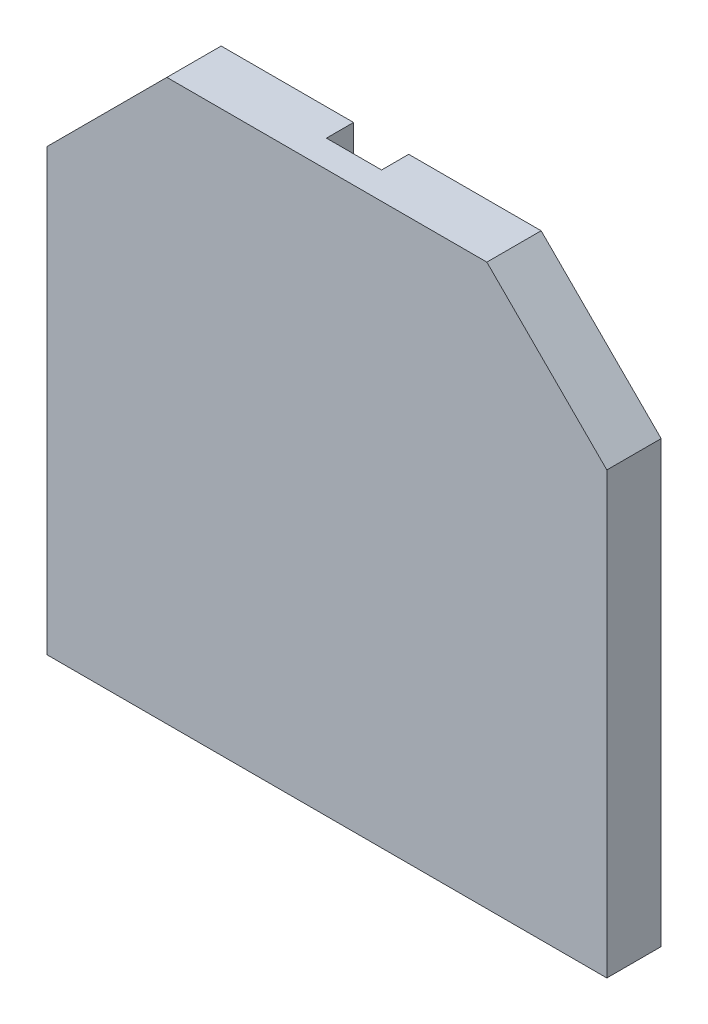
ISO-10303-21;
HEADER;
FILE_DESCRIPTION(('STEP AP214'),'2;1');
FILE_NAME('part.step','',(''),(''),'','','');
FILE_SCHEMA(('AUTOMOTIVE_DESIGN { 1 0 10303 214 1 1 1 1 }'));
ENDSEC;
DATA;
#1=APPLICATION_CONTEXT('core data for automotive mechanical design processes');
#2=APPLICATION_PROTOCOL_DEFINITION('international standard','automotive_design',2000,#1);
#3=PRODUCT_CONTEXT('',#1,'mechanical');
#4=PRODUCT('Part','Part','',(#3));
#5=PRODUCT_RELATED_PRODUCT_CATEGORY('part','',(#4));
#6=PRODUCT_DEFINITION_FORMATION('','',#4);
#7=PRODUCT_DEFINITION_CONTEXT('part definition',#1,'design');
#8=PRODUCT_DEFINITION('design','',#6,#7);
#9=PRODUCT_DEFINITION_SHAPE('','',#8);
#10=(LENGTH_UNIT() NAMED_UNIT(*) SI_UNIT(.MILLI.,.METRE.));
#11=(NAMED_UNIT(*) PLANE_ANGLE_UNIT() SI_UNIT($,.RADIAN.));
#12=(NAMED_UNIT(*) SI_UNIT($,.STERADIAN.) SOLID_ANGLE_UNIT());
#13=UNCERTAINTY_MEASURE_WITH_UNIT(LENGTH_MEASURE(1.E-05),#10,'distance_accuracy_value','');
#14=(GEOMETRIC_REPRESENTATION_CONTEXT(3) GLOBAL_UNCERTAINTY_ASSIGNED_CONTEXT((#13)) GLOBAL_UNIT_ASSIGNED_CONTEXT((#10,
#11,#12)) REPRESENTATION_CONTEXT('',''));
#15=CARTESIAN_POINT('',(0.,0.,0.));
#16=DIRECTION('',(0.,0.,1.));
#17=DIRECTION('',(1.,0.,0.));
#18=AXIS2_PLACEMENT_3D('',#15,#16,#17);
#19=CARTESIAN_POINT('',(-0.32500316,0.68579492,0.31999936));
#20=DIRECTION('',(0.,0.,-1.));
#21=DIRECTION('',(-1.,0.,0.));
#22=AXIS2_PLACEMENT_3D('',#19,#20,#21);
#23=PLANE('',#22);
#24=DIRECTION('',(-1.,0.,0.));
#25=VECTOR('',#24,1.);
#26=CARTESIAN_POINT('',(-0.32500316,0.48579532,0.31999936));
#27=LINE('',#26,#25);
#28=CARTESIAN_POINT('',(-0.32500316,0.48579532,0.31999936));
#29=VERTEX_POINT('',#28);
#30=CARTESIAN_POINT('',(0.32499808,0.48579532,0.31999936));
#31=VERTEX_POINT('',#30);
#32=EDGE_CURVE('E20',#29,#31,#27,.F.);
#33=ORIENTED_EDGE('',*,*,#32,.T.);
#34=DIRECTION('',(0.,1.,0.));
#35=VECTOR('',#34,1.);
#36=CARTESIAN_POINT('',(0.32499808,-1.91420496,0.31999936));
#37=LINE('',#36,#35);
#38=CARTESIAN_POINT('',(0.32499808,-1.91420496,0.31999936));
#39=VERTEX_POINT('',#38);
#40=EDGE_CURVE('E115',#39,#31,#37,.T.);
#41=ORIENTED_EDGE('',*,*,#40,.F.);
#42=DIRECTION('',(1.,0.,0.));
#43=VECTOR('',#42,1.);
#44=CARTESIAN_POINT('',(-0.32500316,-1.91420496,0.31999936));
#45=LINE('',#44,#43);
#46=CARTESIAN_POINT('',(-0.32500316,-1.91420496,0.31999936));
#47=VERTEX_POINT('',#46);
#48=EDGE_CURVE('E132',#47,#39,#45,.T.);
#49=ORIENTED_EDGE('',*,*,#48,.F.);
#50=DIRECTION('',(0.,1.,0.));
#51=VECTOR('',#50,1.);
#52=CARTESIAN_POINT('',(-0.32500316,0.68579492,0.31999936));
#53=LINE('',#52,#51);
#54=EDGE_CURVE('E120',#29,#47,#53,.F.);
#55=ORIENTED_EDGE('',*,*,#54,.F.);
#56=EDGE_LOOP('',(#33,#41,#49,#55));
#57=FACE_BOUND('',#56,.T.);
#58=ADVANCED_FACE('F17',(#57),#23,.T.);
#59=CARTESIAN_POINT('',(-0.32500316,-3.71420136,0.31999936));
#60=DIRECTION('',(0.,0.,-1.));
#61=DIRECTION('',(-1.,0.,0.));
#62=AXIS2_PLACEMENT_3D('',#59,#60,#61);
#63=PLANE('',#62);
#64=DIRECTION('',(-1.,0.,0.));
#65=VECTOR('',#64,1.);
#66=CARTESIAN_POINT('',(-0.32500316,-6.11420164,0.31999936));
#67=LINE('',#66,#65);
#68=CARTESIAN_POINT('',(0.32499808,-6.11420164,0.31999936));
#69=VERTEX_POINT('',#68);
#70=CARTESIAN_POINT('',(-0.32500316,-6.11420164,0.31999936));
#71=VERTEX_POINT('',#70);
#72=EDGE_CURVE('E123',#69,#71,#67,.T.);
#73=ORIENTED_EDGE('',*,*,#72,.T.);
#74=DIRECTION('',(0.,1.,0.));
#75=VECTOR('',#74,1.);
#76=CARTESIAN_POINT('',(-0.32500316,-3.71420136,0.31999936));
#77=LINE('',#76,#75);
#78=CARTESIAN_POINT('',(-0.32500316,-3.71420136,0.31999936));
#79=VERTEX_POINT('',#78);
#80=EDGE_CURVE('E148',#79,#71,#77,.F.);
#81=ORIENTED_EDGE('',*,*,#80,.F.);
#82=DIRECTION('',(1.,0.,0.));
#83=VECTOR('',#82,1.);
#84=CARTESIAN_POINT('',(0.32499808,-3.71420136,0.31999936));
#85=LINE('',#84,#83);
#86=CARTESIAN_POINT('',(0.32499808,-3.71420136,0.31999936));
#87=VERTEX_POINT('',#86);
#88=EDGE_CURVE('E153',#87,#79,#85,.F.);
#89=ORIENTED_EDGE('',*,*,#88,.F.);
#90=DIRECTION('',(0.,1.,0.));
#91=VECTOR('',#90,1.);
#92=CARTESIAN_POINT('',(0.32499808,-6.31420124,0.31999936));
#93=LINE('',#92,#91);
#94=EDGE_CURVE('E165',#69,#87,#93,.T.);
#95=ORIENTED_EDGE('',*,*,#94,.F.);
#96=EDGE_LOOP('',(#73,#81,#89,#95));
#97=FACE_BOUND('',#96,.T.);
#98=ADVANCED_FACE('F251',(#97),#63,.T.);
#99=CARTESIAN_POINT('',(0.32499808,-1.91420496,-1.00000054));
#100=DIRECTION('',(-1.,0.,0.));
#101=DIRECTION('',(0.,0.,1.));
#102=AXIS2_PLACEMENT_3D('',#99,#100,#101);
#103=PLANE('',#102);
#104=DIRECTION('',(0.,0.,1.));
#105=VECTOR('',#104,1.);
#106=CARTESIAN_POINT('',(0.32499808,0.48579532,-1.00000054));
#107=LINE('',#106,#105);
#108=CARTESIAN_POINT('',(0.32499808,0.48579532,0.));
#109=VERTEX_POINT('',#108);
#110=EDGE_CURVE('E125',#31,#109,#107,.F.);
#111=ORIENTED_EDGE('',*,*,#110,.T.);
#112=DIRECTION('',(0.,1.,0.));
#113=VECTOR('',#112,1.);
#114=CARTESIAN_POINT('',(0.32499808,0.48579532,0.));
#115=LINE('',#114,#113);
#116=CARTESIAN_POINT('',(0.32499808,-1.91420496,0.));
#117=VERTEX_POINT('',#116);
#118=EDGE_CURVE('E168',#109,#117,#115,.F.);
#119=ORIENTED_EDGE('',*,*,#118,.T.);
#120=DIRECTION('',(0.,0.,1.));
#121=VECTOR('',#120,1.);
#122=CARTESIAN_POINT('',(0.32499808,-1.91420496,-1.00000054));
#123=LINE('',#122,#121);
#124=EDGE_CURVE('E136',#39,#117,#123,.F.);
#125=ORIENTED_EDGE('',*,*,#124,.F.);
#126=ORIENTED_EDGE('',*,*,#40,.T.);
#127=EDGE_LOOP('',(#111,#119,#125,#126));
#128=FACE_BOUND('',#127,.T.);
#129=ADVANCED_FACE('F134',(#128),#103,.T.);
#130=CARTESIAN_POINT('',(-0.32500316,-1.91420496,-1.00000054));
#131=DIRECTION('',(0.,1.,0.));
#132=DIRECTION('',(0.,0.,1.));
#133=AXIS2_PLACEMENT_3D('',#130,#131,#132);
#134=PLANE('',#133);
#135=ORIENTED_EDGE('',*,*,#124,.T.);
#136=DIRECTION('',(1.,0.,0.));
#137=VECTOR('',#136,1.);
#138=CARTESIAN_POINT('',(-1.88578998,-1.91420496,0.));
#139=LINE('',#138,#137);
#140=CARTESIAN_POINT('',(-0.32500316,-1.91420496,0.));
#141=VERTEX_POINT('',#140);
#142=EDGE_CURVE('E170',#117,#141,#139,.F.);
#143=ORIENTED_EDGE('',*,*,#142,.T.);
#144=DIRECTION('',(0.,0.,-1.));
#145=VECTOR('',#144,1.);
#146=CARTESIAN_POINT('',(-0.32500316,-1.91420496,-1.00000054));
#147=LINE('',#146,#145);
#148=EDGE_CURVE('E142',#47,#141,#147,.T.);
#149=ORIENTED_EDGE('',*,*,#148,.F.);
#150=ORIENTED_EDGE('',*,*,#48,.T.);
#151=EDGE_LOOP('',(#135,#143,#149,#150));
#152=FACE_BOUND('',#151,.T.);
#153=ADVANCED_FACE('F271',(#152),#134,.T.);
#154=CARTESIAN_POINT('',(-0.32500316,0.68579492,-1.00000054));
#155=DIRECTION('',(1.,0.,0.));
#156=DIRECTION('',(0.,0.,-1.));
#157=AXIS2_PLACEMENT_3D('',#154,#155,#156);
#158=PLANE('',#157);
#159=DIRECTION('',(0.,0.,-1.));
#160=VECTOR('',#159,1.);
#161=CARTESIAN_POINT('',(-0.32500316,0.48579532,-1.00000054));
#162=LINE('',#161,#160);
#163=CARTESIAN_POINT('',(-0.32500316,0.48579532,0.));
#164=VERTEX_POINT('',#163);
#165=EDGE_CURVE('E145',#164,#29,#162,.F.);
#166=ORIENTED_EDGE('',*,*,#165,.T.);
#167=ORIENTED_EDGE('',*,*,#54,.T.);
#168=ORIENTED_EDGE('',*,*,#148,.T.);
#169=DIRECTION('',(0.,1.,0.));
#170=VECTOR('',#169,1.);
#171=CARTESIAN_POINT('',(-0.32500316,0.48579532,0.));
#172=LINE('',#171,#170);
#173=EDGE_CURVE('E172',#141,#164,#172,.T.);
#174=ORIENTED_EDGE('',*,*,#173,.T.);
#175=EDGE_LOOP('',(#166,#167,#168,#174));
#176=FACE_BOUND('',#175,.T.);
#177=ADVANCED_FACE('F268',(#176),#158,.T.);
#178=CARTESIAN_POINT('',(-0.32500316,-3.71420136,-1.00000054));
#179=DIRECTION('',(1.,0.,0.));
#180=DIRECTION('',(0.,0.,-1.));
#181=AXIS2_PLACEMENT_3D('',#178,#179,#180);
#182=PLANE('',#181);
#183=DIRECTION('',(0.,0.,-1.));
#184=VECTOR('',#183,1.);
#185=CARTESIAN_POINT('',(-0.32500316,-6.11420164,-1.00000054));
#186=LINE('',#185,#184);
#187=CARTESIAN_POINT('',(-0.32500316,-6.11420164,0.));
#188=VERTEX_POINT('',#187);
#189=EDGE_CURVE('E151',#71,#188,#186,.T.);
#190=ORIENTED_EDGE('',*,*,#189,.T.);
#191=DIRECTION('',(0.,1.,0.));
#192=VECTOR('',#191,1.);
#193=CARTESIAN_POINT('',(-0.32500316,0.48579532,0.));
#194=LINE('',#193,#192);
#195=CARTESIAN_POINT('',(-0.32500316,-3.71420136,0.));
#196=VERTEX_POINT('',#195);
#197=EDGE_CURVE('E175',#188,#196,#194,.T.);
#198=ORIENTED_EDGE('',*,*,#197,.T.);
#199=DIRECTION('',(0.,0.,-1.));
#200=VECTOR('',#199,1.);
#201=CARTESIAN_POINT('',(-0.32500316,-3.71420136,-1.00000054));
#202=LINE('',#201,#200);
#203=EDGE_CURVE('E156',#79,#196,#202,.T.);
#204=ORIENTED_EDGE('',*,*,#203,.F.);
#205=ORIENTED_EDGE('',*,*,#80,.T.);
#206=EDGE_LOOP('',(#190,#198,#204,#205));
#207=FACE_BOUND('',#206,.T.);
#208=ADVANCED_FACE('F245',(#207),#182,.T.);
#209=CARTESIAN_POINT('',(0.32499808,-3.71420136,-1.00000054));
#210=DIRECTION('',(0.,-1.,0.));
#211=DIRECTION('',(0.,0.,-1.));
#212=AXIS2_PLACEMENT_3D('',#209,#210,#211);
#213=PLANE('',#212);
#214=ORIENTED_EDGE('',*,*,#203,.T.);
#215=DIRECTION('',(1.,0.,0.));
#216=VECTOR('',#215,1.);
#217=CARTESIAN_POINT('',(-1.88578998,-3.71420136,0.));
#218=LINE('',#217,#216);
#219=CARTESIAN_POINT('',(0.32499808,-3.71420136,0.));
#220=VERTEX_POINT('',#219);
#221=EDGE_CURVE('E177',#196,#220,#218,.T.);
#222=ORIENTED_EDGE('',*,*,#221,.T.);
#223=DIRECTION('',(0.,0.,1.));
#224=VECTOR('',#223,1.);
#225=CARTESIAN_POINT('',(0.32499808,-3.71420136,-1.00000054));
#226=LINE('',#225,#224);
#227=EDGE_CURVE('E159',#87,#220,#226,.F.);
#228=ORIENTED_EDGE('',*,*,#227,.F.);
#229=ORIENTED_EDGE('',*,*,#88,.T.);
#230=EDGE_LOOP('',(#214,#222,#228,#229));
#231=FACE_BOUND('',#230,.T.);
#232=ADVANCED_FACE('F247',(#231),#213,.T.);
#233=CARTESIAN_POINT('',(0.32499808,-6.31420124,-1.00000054));
#234=DIRECTION('',(-1.,0.,0.));
#235=DIRECTION('',(0.,0.,1.));
#236=AXIS2_PLACEMENT_3D('',#233,#234,#235);
#237=PLANE('',#236);
#238=DIRECTION('',(0.,0.,1.));
#239=VECTOR('',#238,1.);
#240=CARTESIAN_POINT('',(0.32499808,-6.11420164,-1.00000054));
#241=LINE('',#240,#239);
#242=CARTESIAN_POINT('',(0.32499808,-6.11420164,0.));
#243=VERTEX_POINT('',#242);
#244=EDGE_CURVE('E162',#243,#69,#241,.T.);
#245=ORIENTED_EDGE('',*,*,#244,.T.);
#246=ORIENTED_EDGE('',*,*,#94,.T.);
#247=ORIENTED_EDGE('',*,*,#227,.T.);
#248=DIRECTION('',(0.,1.,0.));
#249=VECTOR('',#248,1.);
#250=CARTESIAN_POINT('',(0.32499808,0.48579532,0.));
#251=LINE('',#250,#249);
#252=EDGE_CURVE('E179',#220,#243,#251,.F.);
#253=ORIENTED_EDGE('',*,*,#252,.T.);
#254=EDGE_LOOP('',(#245,#246,#247,#253));
#255=FACE_BOUND('',#254,.T.);
#256=ADVANCED_FACE('F255',(#255),#237,.T.);
#257=CARTESIAN_POINT('',(-1.88578998,0.48579532,0.));
#258=DIRECTION('',(0.,0.,1.));
#259=DIRECTION('',(1.,0.,0.));
#260=AXIS2_PLACEMENT_3D('',#257,#258,#259);
#261=PLANE('',#260);
#262=DIRECTION('',(-0.707106781186548,0.707106781186548,0.));
#263=VECTOR('',#262,1.);
#264=CARTESIAN_POINT('',(1.8857849,0.48579532,0.));
#265=LINE('',#264,#263);
#266=CARTESIAN_POINT('',(3.29999848,-0.92841826,0.));
#267=VERTEX_POINT('',#266);
#268=CARTESIAN_POINT('',(1.8857849,0.48579532,0.));
#269=VERTEX_POINT('',#268);
#270=EDGE_CURVE('E182',#267,#269,#265,.T.);
#271=ORIENTED_EDGE('',*,*,#270,.F.);
#272=DIRECTION('',(0.,1.,0.));
#273=VECTOR('',#272,1.);
#274=CARTESIAN_POINT('',(3.29999848,-0.92841826,0.));
#275=LINE('',#274,#273);
#276=CARTESIAN_POINT('',(3.29999848,-6.11420164,0.));
#277=VERTEX_POINT('',#276);
#278=EDGE_CURVE('E209',#277,#267,#275,.T.);
#279=ORIENTED_EDGE('',*,*,#278,.F.);
#280=DIRECTION('',(1.,0.,0.));
#281=VECTOR('',#280,1.);
#282=CARTESIAN_POINT('',(3.29999848,-6.11420164,0.));
#283=LINE('',#282,#281);
#284=EDGE_CURVE('E206',#243,#277,#283,.T.);
#285=ORIENTED_EDGE('',*,*,#284,.F.);
#286=ORIENTED_EDGE('',*,*,#252,.F.);
#287=ORIENTED_EDGE('',*,*,#221,.F.);
#288=ORIENTED_EDGE('',*,*,#197,.F.);
#289=DIRECTION('',(1.,0.,0.));
#290=VECTOR('',#289,1.);
#291=CARTESIAN_POINT('',(3.29999848,-6.11420164,0.));
#292=LINE('',#291,#290);
#293=CARTESIAN_POINT('',(-3.30000356,-6.11420164,0.));
#294=VERTEX_POINT('',#293);
#295=EDGE_CURVE('E203',#294,#188,#292,.T.);
#296=ORIENTED_EDGE('',*,*,#295,.F.);
#297=DIRECTION('',(0.,1.,0.));
#298=VECTOR('',#297,1.);
#299=CARTESIAN_POINT('',(-3.30000356,-6.11420164,0.));
#300=LINE('',#299,#298);
#301=CARTESIAN_POINT('',(-3.30000356,-0.92841826,0.));
#302=VERTEX_POINT('',#301);
#303=EDGE_CURVE('E198',#302,#294,#300,.F.);
#304=ORIENTED_EDGE('',*,*,#303,.F.);
#305=DIRECTION('',(-0.707106781186548,-0.707106781186548,0.));
#306=VECTOR('',#305,1.);
#307=CARTESIAN_POINT('',(-3.30000356,-0.92841826,0.));
#308=LINE('',#307,#306);
#309=CARTESIAN_POINT('',(-1.88578998,0.48579532,0.));
#310=VERTEX_POINT('',#309);
#311=EDGE_CURVE('E193',#310,#302,#308,.T.);
#312=ORIENTED_EDGE('',*,*,#311,.F.);
#313=DIRECTION('',(1.,0.,0.));
#314=VECTOR('',#313,1.);
#315=CARTESIAN_POINT('',(-1.88578998,0.48579532,0.));
#316=LINE('',#315,#314);
#317=EDGE_CURVE('E186',#164,#310,#316,.F.);
#318=ORIENTED_EDGE('',*,*,#317,.F.);
#319=ORIENTED_EDGE('',*,*,#173,.F.);
#320=ORIENTED_EDGE('',*,*,#142,.F.);
#321=ORIENTED_EDGE('',*,*,#118,.F.);
#322=DIRECTION('',(1.,0.,0.));
#323=VECTOR('',#322,1.);
#324=CARTESIAN_POINT('',(-1.88578998,0.48579532,0.));
#325=LINE('',#324,#323);
#326=EDGE_CURVE('E129',#269,#109,#325,.F.);
#327=ORIENTED_EDGE('',*,*,#326,.F.);
#328=EDGE_LOOP('',(#271,#279,#285,#286,#287,#288,#296,#304,#312,#318,#319,#320,#321,#327));
#329=FACE_BOUND('',#328,.T.);
#330=ADVANCED_FACE('F240',(#329),#261,.F.);
#331=CARTESIAN_POINT('',(1.8857849,0.48579532,0.));
#332=DIRECTION('',(0.707106781186548,0.707106781186548,0.));
#333=DIRECTION('',(-0.707106781186548,0.707106781186548,0.));
#334=AXIS2_PLACEMENT_3D('',#331,#332,#333);
#335=PLANE('',#334);
#336=DIRECTION('',(0.,0.,1.));
#337=VECTOR('',#336,1.);
#338=CARTESIAN_POINT('',(1.8857849,0.48579532,0.));
#339=LINE('',#338,#337);
#340=CARTESIAN_POINT('',(1.8857849,0.48579532,0.64000126));
#341=VERTEX_POINT('',#340);
#342=EDGE_CURVE('E188',#341,#269,#339,.F.);
#343=ORIENTED_EDGE('',*,*,#342,.F.);
#344=DIRECTION('',(-0.707106781186548,0.707106781186547,0.));
#345=VECTOR('',#344,1.);
#346=CARTESIAN_POINT('',(3.29999848,-0.92841826,0.64000126));
#347=LINE('',#346,#345);
#348=CARTESIAN_POINT('',(3.29999848,-0.92841826,0.64000126));
#349=VERTEX_POINT('',#348);
#350=EDGE_CURVE('E215',#349,#341,#347,.T.);
#351=ORIENTED_EDGE('',*,*,#350,.F.);
#352=DIRECTION('',(0.,0.,-1.));
#353=VECTOR('',#352,1.);
#354=CARTESIAN_POINT('',(3.29999848,-0.92841826,0.));
#355=LINE('',#354,#353);
#356=EDGE_CURVE('E212',#267,#349,#355,.F.);
#357=ORIENTED_EDGE('',*,*,#356,.F.);
#358=ORIENTED_EDGE('',*,*,#270,.T.);
#359=EDGE_LOOP('',(#343,#351,#357,#358));
#360=FACE_BOUND('',#359,.T.);
#361=ADVANCED_FACE('F260',(#360),#335,.T.);
#362=CARTESIAN_POINT('',(-1.88578998,0.48579532,0.));
#363=DIRECTION('',(0.,1.,0.));
#364=DIRECTION('',(0.,0.,1.));
#365=AXIS2_PLACEMENT_3D('',#362,#363,#364);
#366=PLANE('',#365);
#367=DIRECTION('',(1.,0.,0.));
#368=VECTOR('',#367,1.);
#369=CARTESIAN_POINT('',(-1.88578998,0.48579532,0.64000126));
#370=LINE('',#369,#368);
#371=CARTESIAN_POINT('',(-1.88578998,0.48579532,0.64000126));
#372=VERTEX_POINT('',#371);
#373=EDGE_CURVE('E218',#341,#372,#370,.F.);
#374=ORIENTED_EDGE('',*,*,#373,.F.);
#375=ORIENTED_EDGE('',*,*,#342,.T.);
#376=ORIENTED_EDGE('',*,*,#326,.T.);
#377=ORIENTED_EDGE('',*,*,#110,.F.);
#378=ORIENTED_EDGE('',*,*,#32,.F.);
#379=ORIENTED_EDGE('',*,*,#165,.F.);
#380=ORIENTED_EDGE('',*,*,#317,.T.);
#381=DIRECTION('',(0.,0.,1.));
#382=VECTOR('',#381,1.);
#383=CARTESIAN_POINT('',(-1.88578998,0.48579532,0.));
#384=LINE('',#383,#382);
#385=EDGE_CURVE('E190',#372,#310,#384,.F.);
#386=ORIENTED_EDGE('',*,*,#385,.F.);
#387=EDGE_LOOP('',(#374,#375,#376,#377,#378,#379,#380,#386));
#388=FACE_BOUND('',#387,.T.);
#389=ADVANCED_FACE('F127',(#388),#366,.T.);
#390=CARTESIAN_POINT('',(-3.30000356,-0.92841826,0.));
#391=DIRECTION('',(-0.707106781186548,0.707106781186548,0.));
#392=DIRECTION('',(-0.707106781186548,-0.707106781186548,0.));
#393=AXIS2_PLACEMENT_3D('',#390,#391,#392);
#394=PLANE('',#393);
#395=DIRECTION('',(0.,0.,1.));
#396=VECTOR('',#395,1.);
#397=CARTESIAN_POINT('',(-3.30000356,-0.92841826,0.));
#398=LINE('',#397,#396);
#399=CARTESIAN_POINT('',(-3.30000356,-0.92841826,0.64000126));
#400=VERTEX_POINT('',#399);
#401=EDGE_CURVE('E195',#400,#302,#398,.F.);
#402=ORIENTED_EDGE('',*,*,#401,.F.);
#403=DIRECTION('',(-0.707106781186548,-0.707106781186547,0.));
#404=VECTOR('',#403,1.);
#405=CARTESIAN_POINT('',(-1.88578998,0.48579532,0.64000126));
#406=LINE('',#405,#404);
#407=EDGE_CURVE('E221',#372,#400,#406,.T.);
#408=ORIENTED_EDGE('',*,*,#407,.F.);
#409=ORIENTED_EDGE('',*,*,#385,.T.);
#410=ORIENTED_EDGE('',*,*,#311,.T.);
#411=EDGE_LOOP('',(#402,#408,#409,#410));
#412=FACE_BOUND('',#411,.T.);
#413=ADVANCED_FACE('F264',(#412),#394,.T.);
#414=CARTESIAN_POINT('',(-3.30000356,-6.11420164,0.));
#415=DIRECTION('',(-1.,0.,0.));
#416=DIRECTION('',(0.,0.,1.));
#417=AXIS2_PLACEMENT_3D('',#414,#415,#416);
#418=PLANE('',#417);
#419=DIRECTION('',(0.,0.,-1.));
#420=VECTOR('',#419,1.);
#421=CARTESIAN_POINT('',(-3.30000356,-6.11420164,0.));
#422=LINE('',#421,#420);
#423=CARTESIAN_POINT('',(-3.30000356,-6.11420164,0.64000126));
#424=VERTEX_POINT('',#423);
#425=EDGE_CURVE('E200',#424,#294,#422,.T.);
#426=ORIENTED_EDGE('',*,*,#425,.F.);
#427=DIRECTION('',(0.,1.,0.));
#428=VECTOR('',#427,1.);
#429=CARTESIAN_POINT('',(-3.30000356,0.48579532,0.64000126));
#430=LINE('',#429,#428);
#431=EDGE_CURVE('E224',#400,#424,#430,.F.);
#432=ORIENTED_EDGE('',*,*,#431,.F.);
#433=ORIENTED_EDGE('',*,*,#401,.T.);
#434=ORIENTED_EDGE('',*,*,#303,.T.);
#435=EDGE_LOOP('',(#426,#432,#433,#434));
#436=FACE_BOUND('',#435,.T.);
#437=ADVANCED_FACE('F235',(#436),#418,.T.);
#438=CARTESIAN_POINT('',(3.29999848,-6.11420164,0.));
#439=DIRECTION('',(0.,-1.,0.));
#440=DIRECTION('',(0.,0.,-1.));
#441=AXIS2_PLACEMENT_3D('',#438,#439,#440);
#442=PLANE('',#441);
#443=ORIENTED_EDGE('',*,*,#284,.T.);
#444=DIRECTION('',(0.,0.,-1.));
#445=VECTOR('',#444,1.);
#446=CARTESIAN_POINT('',(3.29999848,-6.11420164,0.));
#447=LINE('',#446,#445);
#448=CARTESIAN_POINT('',(3.29999848,-6.11420164,0.64000126));
#449=VERTEX_POINT('',#448);
#450=EDGE_CURVE('E35',#449,#277,#447,.T.);
#451=ORIENTED_EDGE('',*,*,#450,.F.);
#452=DIRECTION('',(1.,0.,0.));
#453=VECTOR('',#452,1.);
#454=CARTESIAN_POINT('',(-1.88578998,-6.11420164,0.64000126));
#455=LINE('',#454,#453);
#456=EDGE_CURVE('E26',#424,#449,#455,.T.);
#457=ORIENTED_EDGE('',*,*,#456,.F.);
#458=ORIENTED_EDGE('',*,*,#425,.T.);
#459=ORIENTED_EDGE('',*,*,#295,.T.);
#460=ORIENTED_EDGE('',*,*,#189,.F.);
#461=ORIENTED_EDGE('',*,*,#72,.F.);
#462=ORIENTED_EDGE('',*,*,#244,.F.);
#463=EDGE_LOOP('',(#443,#451,#457,#458,#459,#460,#461,#462));
#464=FACE_BOUND('',#463,.T.);
#465=ADVANCED_FACE('F231',(#464),#442,.T.);
#466=CARTESIAN_POINT('',(3.29999848,-0.92841826,0.));
#467=DIRECTION('',(1.,0.,0.));
#468=DIRECTION('',(0.,0.,-1.));
#469=AXIS2_PLACEMENT_3D('',#466,#467,#468);
#470=PLANE('',#469);
#471=ORIENTED_EDGE('',*,*,#356,.T.);
#472=DIRECTION('',(0.,1.,0.));
#473=VECTOR('',#472,1.);
#474=CARTESIAN_POINT('',(3.29999848,0.48579532,0.64000126));
#475=LINE('',#474,#473);
#476=EDGE_CURVE('E11',#449,#349,#475,.T.);
#477=ORIENTED_EDGE('',*,*,#476,.F.);
#478=ORIENTED_EDGE('',*,*,#450,.T.);
#479=ORIENTED_EDGE('',*,*,#278,.T.);
#480=EDGE_LOOP('',(#471,#477,#478,#479));
#481=FACE_BOUND('',#480,.T.);
#482=ADVANCED_FACE('F258',(#481),#470,.T.);
#483=CARTESIAN_POINT('',(-1.88578998,0.48579532,0.64000126));
#484=DIRECTION('',(0.,0.,1.));
#485=DIRECTION('',(1.,0.,0.));
#486=AXIS2_PLACEMENT_3D('',#483,#484,#485);
#487=PLANE('',#486);
#488=ORIENTED_EDGE('',*,*,#456,.T.);
#489=ORIENTED_EDGE('',*,*,#476,.T.);
#490=ORIENTED_EDGE('',*,*,#350,.T.);
#491=ORIENTED_EDGE('',*,*,#373,.T.);
#492=ORIENTED_EDGE('',*,*,#407,.T.);
#493=ORIENTED_EDGE('',*,*,#431,.T.);
#494=EDGE_LOOP('',(#488,#489,#490,#491,#492,#493));
#495=FACE_BOUND('',#494,.T.);
#496=ADVANCED_FACE('F229',(#495),#487,.T.);
#497=CLOSED_SHELL('',(#58,#98,#129,#153,#177,#208,#232,#256,#330,#361,#389,#413,#437,#465,#482,#496));
#498=MANIFOLD_SOLID_BREP('B1',#497);
#499=ADVANCED_BREP_SHAPE_REPRESENTATION('',(#18,#498),#14);
#500=SHAPE_DEFINITION_REPRESENTATION(#9,#499);
ENDSEC;
END-ISO-10303-21;
